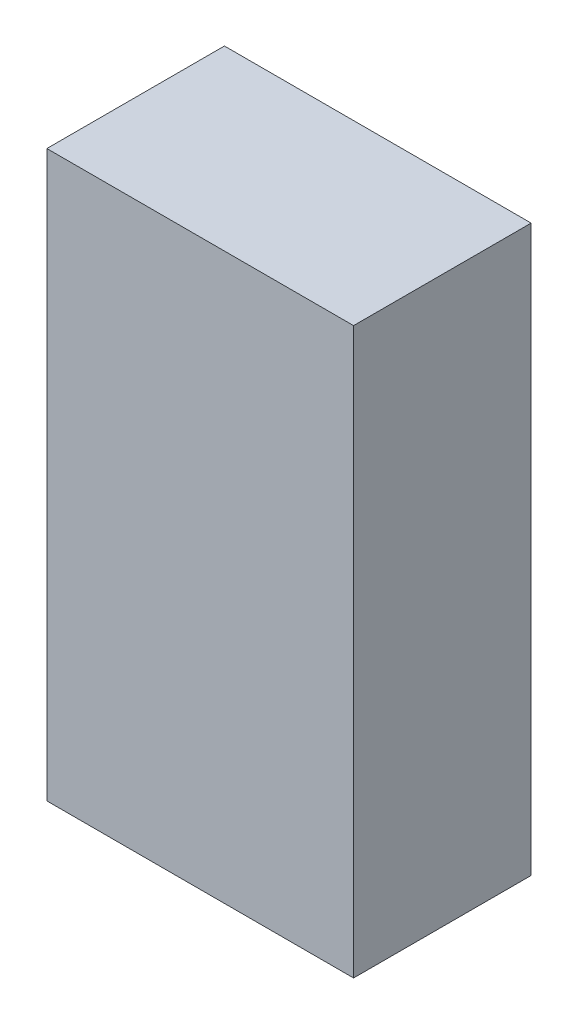
ISO-10303-21;
HEADER;
FILE_DESCRIPTION(('STEP AP214'),'2;1');
FILE_NAME('part.step','',(''),(''),'','','');
FILE_SCHEMA(('AUTOMOTIVE_DESIGN { 1 0 10303 214 1 1 1 1 }'));
ENDSEC;
DATA;
#1=APPLICATION_CONTEXT('core data for automotive mechanical design processes');
#2=APPLICATION_PROTOCOL_DEFINITION('international standard','automotive_design',2000,#1);
#3=PRODUCT_CONTEXT('',#1,'mechanical');
#4=PRODUCT('Part','Part','',(#3));
#5=PRODUCT_RELATED_PRODUCT_CATEGORY('part','',(#4));
#6=PRODUCT_DEFINITION_FORMATION('','',#4);
#7=PRODUCT_DEFINITION_CONTEXT('part definition',#1,'design');
#8=PRODUCT_DEFINITION('design','',#6,#7);
#9=PRODUCT_DEFINITION_SHAPE('','',#8);
#10=(LENGTH_UNIT() NAMED_UNIT(*) SI_UNIT(.MILLI.,.METRE.));
#11=(NAMED_UNIT(*) PLANE_ANGLE_UNIT() SI_UNIT($,.RADIAN.));
#12=(NAMED_UNIT(*) SI_UNIT($,.STERADIAN.) SOLID_ANGLE_UNIT());
#13=UNCERTAINTY_MEASURE_WITH_UNIT(LENGTH_MEASURE(1.E-05),#10,'distance_accuracy_value','');
#14=(GEOMETRIC_REPRESENTATION_CONTEXT(3) GLOBAL_UNCERTAINTY_ASSIGNED_CONTEXT((#13)) GLOBAL_UNIT_ASSIGNED_CONTEXT((#10,
#11,#12)) REPRESENTATION_CONTEXT('',''));
#15=CARTESIAN_POINT('',(0.,0.,0.));
#16=DIRECTION('',(0.,0.,1.));
#17=DIRECTION('',(1.,0.,0.));
#18=AXIS2_PLACEMENT_3D('',#15,#16,#17);
#19=CARTESIAN_POINT('',(0.47500032,-0.87499698,0.5499989));
#20=DIRECTION('',(0.,0.,-1.));
#21=DIRECTION('',(-1.,0.,0.));
#22=AXIS2_PLACEMENT_3D('',#19,#20,#21);
#23=PLANE('',#22);
#24=DIRECTION('',(1.,0.,0.));
#25=VECTOR('',#24,1.);
#26=CARTESIAN_POINT('',(0.47499778,0.87499952,0.5499989));
#27=LINE('',#26,#25);
#28=CARTESIAN_POINT('',(0.474997780000001,0.87499952,0.5499989));
#29=VERTEX_POINT('',#28);
#30=CARTESIAN_POINT('',(-0.47500032,0.87499952,0.5499989));
#31=VERTEX_POINT('',#30);
#32=EDGE_CURVE('E54',#29,#31,#27,.F.);
#33=ORIENTED_EDGE('',*,*,#32,.T.);
#34=DIRECTION('',(0.,1.,0.));
#35=VECTOR('',#34,1.);
#36=CARTESIAN_POINT('',(-0.47500032,0.87499952,0.5499989));
#37=LINE('',#36,#35);
#38=CARTESIAN_POINT('',(-0.47500032,-0.87499825,0.5499989));
#39=VERTEX_POINT('',#38);
#40=EDGE_CURVE('E56',#31,#39,#37,.F.);
#41=ORIENTED_EDGE('',*,*,#40,.T.);
#42=DIRECTION('',(-0.999999999996426,-2.67368243605814E-06,0.));
#43=VECTOR('',#42,1.);
#44=CARTESIAN_POINT('',(-0.47500032,-0.87499952,0.5499989));
#45=LINE('',#44,#43);
#46=CARTESIAN_POINT('',(0.474999685,-0.874996979999987,0.5499989));
#47=VERTEX_POINT('',#46);
#48=EDGE_CURVE('E19',#39,#47,#45,.F.);
#49=ORIENTED_EDGE('',*,*,#48,.T.);
#50=DIRECTION('',(1.45143147257392E-06,-0.999999999998947,0.));
#51=VECTOR('',#50,1.);
#52=CARTESIAN_POINT('',(0.47500032,-0.87499698,0.5499989));
#53=LINE('',#52,#51);
#54=EDGE_CURVE('E79',#47,#29,#53,.F.);
#55=ORIENTED_EDGE('',*,*,#54,.T.);
#56=EDGE_LOOP('',(#33,#41,#49,#55));
#57=FACE_BOUND('',#56,.T.);
#58=ADVANCED_FACE('F16',(#57),#23,.F.);
#59=CARTESIAN_POINT('',(-0.47500032,-0.87499952,0.));
#60=DIRECTION('',(-2.67368243605814E-06,0.999999999996426,0.));
#61=DIRECTION('',(-0.999999999996426,-2.67368243605814E-06,0.));
#62=AXIS2_PLACEMENT_3D('',#59,#60,#61);
#63=PLANE('',#62);
#64=DIRECTION('',(0.,0.,1.));
#65=VECTOR('',#64,1.);
#66=CARTESIAN_POINT('',(0.47500032,-0.87499698,0.));
#67=LINE('',#66,#65);
#68=CARTESIAN_POINT('',(0.474999685,-0.874996979999987,0.));
#69=VERTEX_POINT('',#68);
#70=EDGE_CURVE('E67',#69,#47,#67,.T.);
#71=ORIENTED_EDGE('',*,*,#70,.T.);
#72=ORIENTED_EDGE('',*,*,#48,.F.);
#73=DIRECTION('',(0.,0.,-1.));
#74=VECTOR('',#73,1.);
#75=CARTESIAN_POINT('',(-0.47500032,-0.87499952,0.));
#76=LINE('',#75,#74);
#77=CARTESIAN_POINT('',(-0.47500032,-0.874998885,0.));
#78=VERTEX_POINT('',#77);
#79=EDGE_CURVE('E62',#39,#78,#76,.T.);
#80=ORIENTED_EDGE('',*,*,#79,.T.);
#81=DIRECTION('',(-1.,0.,0.));
#82=VECTOR('',#81,1.);
#83=CARTESIAN_POINT('',(0.47500032,-0.87499698,0.));
#84=LINE('',#83,#82);
#85=EDGE_CURVE('E82',#69,#78,#84,.T.);
#86=ORIENTED_EDGE('',*,*,#85,.F.);
#87=EDGE_LOOP('',(#71,#72,#80,#86));
#88=FACE_BOUND('',#87,.T.);
#89=ADVANCED_FACE('F64',(#88),#63,.F.);
#90=CARTESIAN_POINT('',(-0.47500032,0.87499952,0.));
#91=DIRECTION('',(1.,0.,0.));
#92=DIRECTION('',(0.,0.,-1.));
#93=AXIS2_PLACEMENT_3D('',#90,#91,#92);
#94=PLANE('',#93);
#95=ORIENTED_EDGE('',*,*,#79,.F.);
#96=ORIENTED_EDGE('',*,*,#40,.F.);
#97=DIRECTION('',(0.,0.,-1.));
#98=VECTOR('',#97,1.);
#99=CARTESIAN_POINT('',(-0.47500032,0.87499952,0.));
#100=LINE('',#99,#98);
#101=CARTESIAN_POINT('',(-0.47500032,0.87499952,0.));
#102=VERTEX_POINT('',#101);
#103=EDGE_CURVE('E74',#31,#102,#100,.T.);
#104=ORIENTED_EDGE('',*,*,#103,.T.);
#105=DIRECTION('',(0.,1.,0.));
#106=VECTOR('',#105,1.);
#107=CARTESIAN_POINT('',(-0.47500032,-0.87499698,0.));
#108=LINE('',#107,#106);
#109=EDGE_CURVE('E71',#78,#102,#108,.T.);
#110=ORIENTED_EDGE('',*,*,#109,.F.);
#111=EDGE_LOOP('',(#95,#96,#104,#110));
#112=FACE_BOUND('',#111,.T.);
#113=ADVANCED_FACE('F69',(#112),#94,.F.);
#114=CARTESIAN_POINT('',(0.47499778,0.87499952,0.));
#115=DIRECTION('',(0.,-1.,0.));
#116=DIRECTION('',(0.,0.,-1.));
#117=AXIS2_PLACEMENT_3D('',#114,#115,#116);
#118=PLANE('',#117);
#119=ORIENTED_EDGE('',*,*,#103,.F.);
#120=ORIENTED_EDGE('',*,*,#32,.F.);
#121=DIRECTION('',(0.,0.,1.));
#122=VECTOR('',#121,1.);
#123=CARTESIAN_POINT('',(0.474997780000003,0.87499952,0.));
#124=LINE('',#123,#122);
#125=CARTESIAN_POINT('',(0.474997780000001,0.87499952,0.));
#126=VERTEX_POINT('',#125);
#127=EDGE_CURVE('E34',#29,#126,#124,.F.);
#128=ORIENTED_EDGE('',*,*,#127,.T.);
#129=DIRECTION('',(-1.,0.,0.));
#130=VECTOR('',#129,1.);
#131=CARTESIAN_POINT('',(0.47500032,0.87499952,0.));
#132=LINE('',#131,#130);
#133=EDGE_CURVE('E25',#102,#126,#132,.F.);
#134=ORIENTED_EDGE('',*,*,#133,.F.);
#135=EDGE_LOOP('',(#119,#120,#128,#134));
#136=FACE_BOUND('',#135,.T.);
#137=ADVANCED_FACE('F88',(#136),#118,.F.);
#138=CARTESIAN_POINT('',(0.47500032,-0.87499698,0.));
#139=DIRECTION('',(-0.999999999998947,-1.45143147257392E-06,0.));
#140=DIRECTION('',(1.45143147257392E-06,-0.999999999998947,0.));
#141=AXIS2_PLACEMENT_3D('',#138,#139,#140);
#142=PLANE('',#141);
#143=ORIENTED_EDGE('',*,*,#127,.F.);
#144=ORIENTED_EDGE('',*,*,#54,.F.);
#145=ORIENTED_EDGE('',*,*,#70,.F.);
#146=DIRECTION('',(0.,1.,0.));
#147=VECTOR('',#146,1.);
#148=CARTESIAN_POINT('',(0.47499778,-0.87499698,0.));
#149=LINE('',#148,#147);
#150=EDGE_CURVE('E11',#126,#69,#149,.F.);
#151=ORIENTED_EDGE('',*,*,#150,.F.);
#152=EDGE_LOOP('',(#143,#144,#145,#151));
#153=FACE_BOUND('',#152,.T.);
#154=ADVANCED_FACE('F90',(#153),#142,.F.);
#155=CARTESIAN_POINT('',(0.47500032,-0.87499698,0.));
#156=DIRECTION('',(0.,0.,-1.));
#157=DIRECTION('',(-1.,0.,0.));
#158=AXIS2_PLACEMENT_3D('',#155,#156,#157);
#159=PLANE('',#158);
#160=ORIENTED_EDGE('',*,*,#133,.T.);
#161=ORIENTED_EDGE('',*,*,#150,.T.);
#162=ORIENTED_EDGE('',*,*,#85,.T.);
#163=ORIENTED_EDGE('',*,*,#109,.T.);
#164=EDGE_LOOP('',(#160,#161,#162,#163));
#165=FACE_BOUND('',#164,.T.);
#166=ADVANCED_FACE('F87',(#165),#159,.T.);
#167=CLOSED_SHELL('',(#58,#89,#113,#137,#154,#166));
#168=MANIFOLD_SOLID_BREP('B1',#167);
#169=ADVANCED_BREP_SHAPE_REPRESENTATION('',(#18,#168),#14);
#170=SHAPE_DEFINITION_REPRESENTATION(#9,#169);
ENDSEC;
END-ISO-10303-21;
